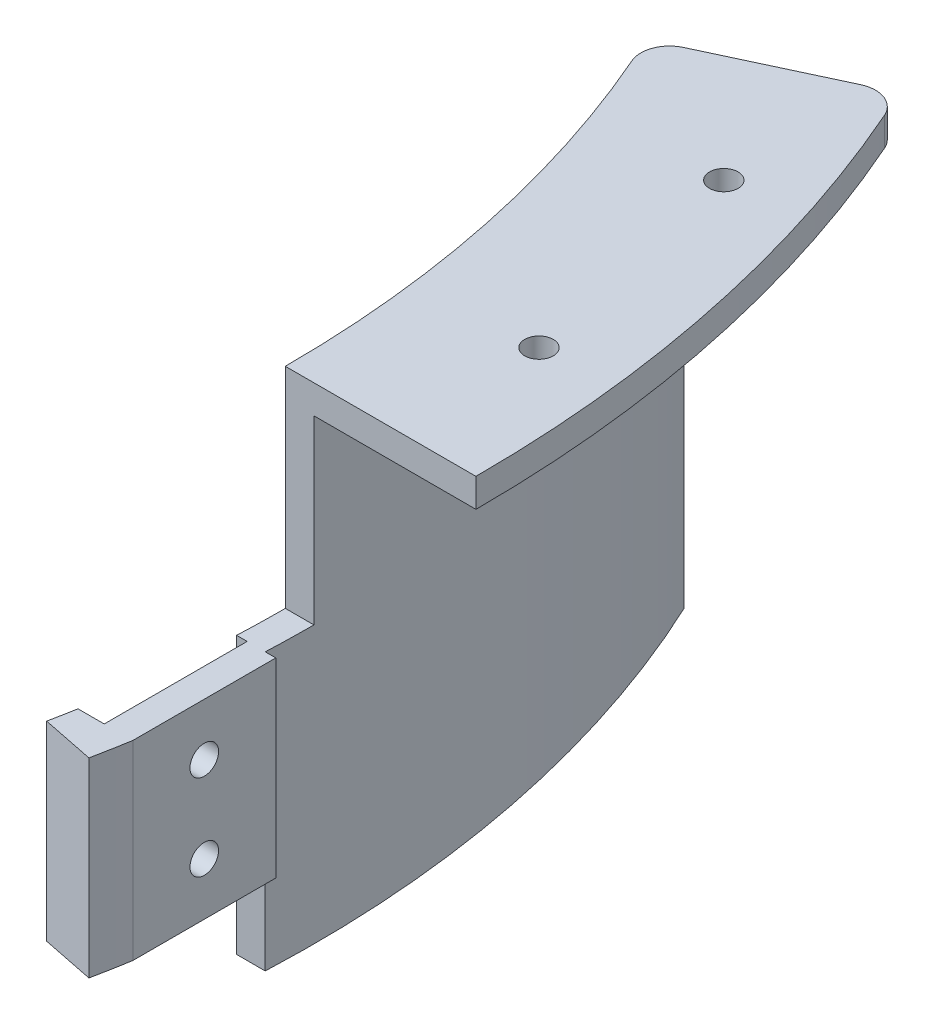
ISO-10303-21;
HEADER;
FILE_DESCRIPTION(('STEP AP214'),'2;1');
FILE_NAME('part.step','',(''),(''),'','','');
FILE_SCHEMA(('AUTOMOTIVE_DESIGN { 1 0 10303 214 1 1 1 1 }'));
ENDSEC;
DATA;
#1=APPLICATION_CONTEXT('core data for automotive mechanical design processes');
#2=APPLICATION_PROTOCOL_DEFINITION('international standard','automotive_design',2000,#1);
#3=PRODUCT_CONTEXT('',#1,'mechanical');
#4=PRODUCT('Part','Part','',(#3));
#5=PRODUCT_RELATED_PRODUCT_CATEGORY('part','',(#4));
#6=PRODUCT_DEFINITION_FORMATION('','',#4);
#7=PRODUCT_DEFINITION_CONTEXT('part definition',#1,'design');
#8=PRODUCT_DEFINITION('design','',#6,#7);
#9=PRODUCT_DEFINITION_SHAPE('','',#8);
#10=(LENGTH_UNIT() NAMED_UNIT(*) SI_UNIT(.MILLI.,.METRE.));
#11=(NAMED_UNIT(*) PLANE_ANGLE_UNIT() SI_UNIT($,.RADIAN.));
#12=(NAMED_UNIT(*) SI_UNIT($,.STERADIAN.) SOLID_ANGLE_UNIT());
#13=UNCERTAINTY_MEASURE_WITH_UNIT(LENGTH_MEASURE(1.E-05),#10,'distance_accuracy_value','');
#14=(GEOMETRIC_REPRESENTATION_CONTEXT(3) GLOBAL_UNCERTAINTY_ASSIGNED_CONTEXT((#13)) GLOBAL_UNIT_ASSIGNED_CONTEXT((#10,
#11,#12)) REPRESENTATION_CONTEXT('',''));
#15=CARTESIAN_POINT('',(0.,0.,0.));
#16=DIRECTION('',(0.,0.,1.));
#17=DIRECTION('',(1.,0.,0.));
#18=AXIS2_PLACEMENT_3D('',#15,#16,#17);
#19=CARTESIAN_POINT('',(0.,-64.,0.));
#20=DIRECTION('',(0.,1.,0.));
#21=DIRECTION('',(0.,0.,1.));
#22=AXIS2_PLACEMENT_3D('',#19,#20,#21);
#23=CYLINDRICAL_SURFACE('',#22,115.);
#24=CARTESIAN_POINT('',(0.,0.,0.));
#25=DIRECTION('',(0.,1.,0.));
#26=DIRECTION('',(0.,0.,1.));
#27=AXIS2_PLACEMENT_3D('',#24,#25,#26);
#28=CIRCLE('',#27,115.);
#29=CARTESIAN_POINT('',(115.,0.,0.));
#30=VERTEX_POINT('',#29);
#31=CARTESIAN_POINT('',(105.427327378107,0.,-45.9355923213096));
#32=VERTEX_POINT('',#31);
#33=EDGE_CURVE('E244',#30,#32,#28,.T.);
#34=ORIENTED_EDGE('',*,*,#33,.T.);
#35=DIRECTION('',(0.,1.,0.));
#36=VECTOR('',#35,1.);
#37=CARTESIAN_POINT('',(105.427327378106,-64.,-45.9355923213096));
#38=LINE('',#37,#36);
#39=CARTESIAN_POINT('',(105.427327378106,-51.,-45.9355923213096));
#40=VERTEX_POINT('',#39);
#41=EDGE_CURVE('E42',#32,#40,#38,.F.);
#42=ORIENTED_EDGE('',*,*,#41,.T.);
#43=CARTESIAN_POINT('',(0.,-51.,0.));
#44=DIRECTION('',(0.,1.,0.));
#45=DIRECTION('',(0.,0.,-1.));
#46=AXIS2_PLACEMENT_3D('',#43,#44,#45);
#47=CIRCLE('',#46,115.);
#48=CARTESIAN_POINT('',(114.891252930761,-51.,4.99999999999999));
#49=VERTEX_POINT('',#48);
#50=EDGE_CURVE('E174',#49,#40,#47,.T.);
#51=ORIENTED_EDGE('',*,*,#50,.F.);
#52=DIRECTION('',(0.,1.,0.));
#53=VECTOR('',#52,1.);
#54=CARTESIAN_POINT('',(114.891252930761,-64.,5.));
#55=LINE('',#54,#53);
#56=CARTESIAN_POINT('',(114.891252930761,-22.,5.00000000000003));
#57=VERTEX_POINT('',#56);
#58=EDGE_CURVE('E173',#49,#57,#55,.T.);
#59=ORIENTED_EDGE('',*,*,#58,.T.);
#60=CARTESIAN_POINT('',(0.,-22.,0.));
#61=DIRECTION('',(0.,1.,0.));
#62=DIRECTION('',(0.,0.,1.));
#63=AXIS2_PLACEMENT_3D('',#60,#61,#62);
#64=CIRCLE('',#63,115.);
#65=CARTESIAN_POINT('',(115.,-22.,0.));
#66=VERTEX_POINT('',#65);
#67=EDGE_CURVE('E193',#66,#57,#64,.F.);
#68=ORIENTED_EDGE('',*,*,#67,.F.);
#69=DIRECTION('',(0.,1.,0.));
#70=VECTOR('',#69,1.);
#71=CARTESIAN_POINT('',(115.,-22.,0.));
#72=LINE('',#71,#70);
#73=EDGE_CURVE('E208',#66,#30,#72,.T.);
#74=ORIENTED_EDGE('',*,*,#73,.T.);
#75=EDGE_LOOP('',(#34,#42,#51,#59,#68,#74));
#76=FACE_BOUND('',#75,.T.);
#77=ADVANCED_FACE('F34',(#76),#23,.F.);
#78=CARTESIAN_POINT('',(113.,-84.,5.));
#79=DIRECTION('',(0.,0.,-1.));
#80=DIRECTION('',(-1.,0.,0.));
#81=AXIS2_PLACEMENT_3D('',#78,#79,#80);
#82=PLANE('',#81);
#83=DIRECTION('',(-1.,0.,0.));
#84=VECTOR('',#83,1.);
#85=CARTESIAN_POINT('',(117.894020204589,-51.,5.));
#86=LINE('',#85,#84);
#87=CARTESIAN_POINT('',(117.894020204589,-51.,5.));
#88=VERTEX_POINT('',#87);
#89=EDGE_CURVE('E158',#88,#49,#86,.T.);
#90=ORIENTED_EDGE('',*,*,#89,.F.);
#91=DIRECTION('',(0.,-1.,0.));
#92=VECTOR('',#91,1.);
#93=CARTESIAN_POINT('',(117.894020204589,-3.,5.));
#94=LINE('',#93,#92);
#95=CARTESIAN_POINT('',(117.894020204589,-42.,5.));
#96=VERTEX_POINT('',#95);
#97=EDGE_CURVE('E170',#96,#88,#94,.T.);
#98=ORIENTED_EDGE('',*,*,#97,.F.);
#99=DIRECTION('',(1.,0.,0.));
#100=VECTOR('',#99,1.);
#101=CARTESIAN_POINT('',(116.,-42.,5.));
#102=LINE('',#101,#100);
#103=CARTESIAN_POINT('',(116.,-42.,5.));
#104=VERTEX_POINT('',#103);
#105=EDGE_CURVE('E316',#104,#96,#102,.T.);
#106=ORIENTED_EDGE('',*,*,#105,.F.);
#107=DIRECTION('',(0.,1.,0.));
#108=VECTOR('',#107,1.);
#109=CARTESIAN_POINT('',(116.,-84.,5.));
#110=LINE('',#109,#108);
#111=CARTESIAN_POINT('',(116.,-22.,5.));
#112=VERTEX_POINT('',#111);
#113=EDGE_CURVE('E242',#104,#112,#110,.T.);
#114=ORIENTED_EDGE('',*,*,#113,.T.);
#115=DIRECTION('',(1.,0.,0.));
#116=VECTOR('',#115,1.);
#117=CARTESIAN_POINT('',(0.,-22.,5.00000000000003));
#118=LINE('',#117,#116);
#119=EDGE_CURVE('E196',#57,#112,#118,.T.);
#120=ORIENTED_EDGE('',*,*,#119,.F.);
#121=ORIENTED_EDGE('',*,*,#58,.F.);
#122=EDGE_LOOP('',(#90,#98,#106,#114,#120,#121));
#123=FACE_BOUND('',#122,.T.);
#124=ADVANCED_FACE('F169',(#123),#82,.F.);
#125=CARTESIAN_POINT('',(0.,-3.,0.));
#126=DIRECTION('',(0.,-1.,0.));
#127=DIRECTION('',(0.,0.,-1.));
#128=AXIS2_PLACEMENT_3D('',#125,#126,#127);
#129=CYLINDRICAL_SURFACE('',#128,118.);
#130=CARTESIAN_POINT('',(0.,-51.,0.));
#131=DIRECTION('',(0.,-1.,0.));
#132=DIRECTION('',(0.,0.,-1.));
#133=AXIS2_PLACEMENT_3D('',#130,#131,#132);
#134=CIRCLE('',#133,118.);
#135=CARTESIAN_POINT('',(106.944318870325,-51.,-49.8689548854027));
#136=VERTEX_POINT('',#135);
#137=EDGE_CURVE('E155',#136,#88,#134,.T.);
#138=ORIENTED_EDGE('',*,*,#137,.F.);
#139=DIRECTION('',(0.,-1.,0.));
#140=VECTOR('',#139,1.);
#141=CARTESIAN_POINT('',(106.944318870325,-3.,-49.8689548854027));
#142=LINE('',#141,#140);
#143=CARTESIAN_POINT('',(106.944318870325,-3.,-49.8689548854027));
#144=VERTEX_POINT('',#143);
#145=EDGE_CURVE('E229',#144,#136,#142,.T.);
#146=ORIENTED_EDGE('',*,*,#145,.F.);
#147=CARTESIAN_POINT('',(0.,-3.,0.));
#148=DIRECTION('',(0.,1.,0.));
#149=DIRECTION('',(0.,0.,-1.));
#150=AXIS2_PLACEMENT_3D('',#147,#148,#149);
#151=CIRCLE('',#150,118.);
#152=CARTESIAN_POINT('',(118.,-3.,0.));
#153=VERTEX_POINT('',#152);
#154=EDGE_CURVE('E222',#153,#144,#151,.T.);
#155=ORIENTED_EDGE('',*,*,#154,.F.);
#156=DIRECTION('',(0.,-1.,0.));
#157=VECTOR('',#156,1.);
#158=CARTESIAN_POINT('',(118.,-3.,0.));
#159=LINE('',#158,#157);
#160=CARTESIAN_POINT('',(118.,-22.,0.));
#161=VERTEX_POINT('',#160);
#162=EDGE_CURVE('E212',#161,#153,#159,.F.);
#163=ORIENTED_EDGE('',*,*,#162,.F.);
#164=CARTESIAN_POINT('',(0.,-22.,0.));
#165=DIRECTION('',(0.,1.,0.));
#166=DIRECTION('',(0.,0.,1.));
#167=AXIS2_PLACEMENT_3D('',#164,#165,#166);
#168=CIRCLE('',#167,118.);
#169=CARTESIAN_POINT('',(117.894020204589,-22.,5.));
#170=VERTEX_POINT('',#169);
#171=EDGE_CURVE('E220',#170,#161,#168,.T.);
#172=ORIENTED_EDGE('',*,*,#171,.F.);
#173=DIRECTION('',(0.,-1.,0.));
#174=VECTOR('',#173,1.);
#175=CARTESIAN_POINT('',(117.894020204589,-3.,5.));
#176=LINE('',#175,#174);
#177=EDGE_CURVE('E180',#170,#96,#176,.T.);
#178=ORIENTED_EDGE('',*,*,#177,.T.);
#179=ORIENTED_EDGE('',*,*,#97,.T.);
#180=EDGE_LOOP('',(#138,#146,#155,#163,#172,#178,#179));
#181=FACE_BOUND('',#180,.T.);
#182=ADVANCED_FACE('F177',(#181),#129,.T.);
#183=CARTESIAN_POINT('',(0.,-64.,0.));
#184=DIRECTION('',(-0.422618261740701,0.,-0.906307787036649));
#185=DIRECTION('',(-0.906307787036649,0.,0.422618261740701));
#186=AXIS2_PLACEMENT_3D('',#183,#184,#185);
#187=PLANE('',#186);
#188=DIRECTION('',(0.906307787036652,0.,-0.422618261740695));
#189=VECTOR('',#188,1.);
#190=CARTESIAN_POINT('',(106.944318870325,-51.,-49.8689548854027));
#191=LINE('',#190,#189);
#192=CARTESIAN_POINT('',(106.9097506984,-51.,-49.8528354821059));
#193=VERTEX_POINT('',#192);
#194=EDGE_CURVE('E160',#193,#136,#191,.T.);
#195=ORIENTED_EDGE('',*,*,#194,.F.);
#196=DIRECTION('',(0.,-1.,0.));
#197=VECTOR('',#196,1.);
#198=CARTESIAN_POINT('',(106.9097506984,0.,-49.8528354821059));
#199=LINE('',#198,#197);
#200=CARTESIAN_POINT('',(106.9097506984,0.,-49.8528354821059));
#201=VERTEX_POINT('',#200);
#202=EDGE_CURVE('E272',#193,#201,#199,.F.);
#203=ORIENTED_EDGE('',*,*,#202,.T.);
#204=DIRECTION('',(-0.906307787036649,0.,0.422618261740701));
#205=VECTOR('',#204,1.);
#206=CARTESIAN_POINT('',(0.,0.,0.));
#207=LINE('',#206,#205);
#208=CARTESIAN_POINT('',(119.601727041651,0.,-55.7712012480857));
#209=VERTEX_POINT('',#208);
#210=EDGE_CURVE('E252',#209,#201,#207,.T.);
#211=ORIENTED_EDGE('',*,*,#210,.F.);
#212=DIRECTION('',(0.,1.,0.));
#213=VECTOR('',#212,1.);
#214=CARTESIAN_POINT('',(119.601727041651,-64.,-55.7712012480857));
#215=LINE('',#214,#213);
#216=CARTESIAN_POINT('',(119.601727041651,-3.,-55.7712012480857));
#217=VERTEX_POINT('',#216);
#218=EDGE_CURVE('E268',#209,#217,#215,.F.);
#219=ORIENTED_EDGE('',*,*,#218,.T.);
#220=DIRECTION('',(0.906307787036649,0.,-0.422618261740701));
#221=VECTOR('',#220,1.);
#222=CARTESIAN_POINT('',(106.944318870325,-3.,-49.8689548854027));
#223=LINE('',#222,#221);
#224=EDGE_CURVE('E224',#144,#217,#223,.T.);
#225=ORIENTED_EDGE('',*,*,#224,.F.);
#226=ORIENTED_EDGE('',*,*,#145,.T.);
#227=EDGE_LOOP('',(#195,#203,#211,#219,#225,#226));
#228=FACE_BOUND('',#227,.T.);
#229=ADVANCED_FACE('F284',(#228),#187,.T.);
#230=CARTESIAN_POINT('',(132.328890592719,-64.,26.7219893439865));
#231=DIRECTION('',(-0.197940661807307,0.,0.980214004390513));
#232=DIRECTION('',(0.980214004390513,0.,0.197940661807307));
#233=AXIS2_PLACEMENT_3D('',#230,#231,#232);
#234=PLANE('',#233);
#235=DIRECTION('',(0.,1.,0.));
#236=VECTOR('',#235,1.);
#237=CARTESIAN_POINT('',(112.724610504909,-64.,22.7631761078404));
#238=LINE('',#237,#236);
#239=CARTESIAN_POINT('',(112.724610504909,-42.,22.7631761078404));
#240=VERTEX_POINT('',#239);
#241=CARTESIAN_POINT('',(112.724610504909,-22.,22.7631761078403));
#242=VERTEX_POINT('',#241);
#243=EDGE_CURVE('E247',#240,#242,#238,.T.);
#244=ORIENTED_EDGE('',*,*,#243,.F.);
#245=DIRECTION('',(-0.980214004390514,0.,-0.197940661807305));
#246=VECTOR('',#245,1.);
#247=CARTESIAN_POINT('',(118.281412986176,-42.,23.8852955182423));
#248=LINE('',#247,#246);
#249=CARTESIAN_POINT('',(118.281412986176,-42.,23.8852955182423));
#250=VERTEX_POINT('',#249);
#251=EDGE_CURVE('E328',#250,#240,#248,.T.);
#252=ORIENTED_EDGE('',*,*,#251,.F.);
#253=DIRECTION('',(0.,-1.,0.));
#254=VECTOR('',#253,1.);
#255=CARTESIAN_POINT('',(118.281412986176,-3.,23.8852955182423));
#256=LINE('',#255,#254);
#257=CARTESIAN_POINT('',(118.281412986176,-22.,23.8852955182423));
#258=VERTEX_POINT('',#257);
#259=EDGE_CURVE('E238',#258,#250,#256,.T.);
#260=ORIENTED_EDGE('',*,*,#259,.F.);
#261=DIRECTION('',(0.980214004390513,0.,0.197940661807307));
#262=VECTOR('',#261,1.);
#263=CARTESIAN_POINT('',(0.,-22.,0.));
#264=LINE('',#263,#262);
#265=EDGE_CURVE('E207',#242,#258,#264,.T.);
#266=ORIENTED_EDGE('',*,*,#265,.F.);
#267=EDGE_LOOP('',(#244,#252,#260,#266));
#268=FACE_BOUND('',#267,.T.);
#269=ADVANCED_FACE('F348',(#268),#234,.T.);
#270=CARTESIAN_POINT('',(0.,-42.,0.));
#271=DIRECTION('',(0.,1.,0.));
#272=DIRECTION('',(0.,0.,-1.));
#273=AXIS2_PLACEMENT_3D('',#270,#271,#272);
#274=CIRCLE('',#273,115.);
#275=CARTESIAN_POINT('',(113.247516529061,-42.,20.));
#276=VERTEX_POINT('',#275);
#277=EDGE_CURVE('E187',#240,#276,#274,.T.);
#278=ORIENTED_EDGE('',*,*,#277,.F.);
#279=ORIENTED_EDGE('',*,*,#243,.T.);
#280=CARTESIAN_POINT('',(0.,-22.,0.));
#281=DIRECTION('',(0.,1.,0.));
#282=DIRECTION('',(0.,0.,1.));
#283=AXIS2_PLACEMENT_3D('',#280,#281,#282);
#284=CIRCLE('',#283,115.);
#285=CARTESIAN_POINT('',(113.247516529061,-22.,20.));
#286=VERTEX_POINT('',#285);
#287=EDGE_CURVE('E204',#286,#242,#284,.F.);
#288=ORIENTED_EDGE('',*,*,#287,.F.);
#289=DIRECTION('',(0.,1.,0.));
#290=VECTOR('',#289,1.);
#291=CARTESIAN_POINT('',(113.247516529061,-64.,20.));
#292=LINE('',#291,#290);
#293=EDGE_CURVE('E254',#286,#276,#292,.F.);
#294=ORIENTED_EDGE('',*,*,#293,.T.);
#295=EDGE_LOOP('',(#278,#279,#288,#294));
#296=FACE_BOUND('',#295,.T.);
#297=ADVANCED_FACE('F342',(#296),#23,.F.);
#298=CARTESIAN_POINT('',(116.,-84.,5.));
#299=DIRECTION('',(1.,0.,0.));
#300=DIRECTION('',(0.,0.,-1.));
#301=AXIS2_PLACEMENT_3D('',#298,#299,#300);
#302=PLANE('',#301);
#303=CARTESIAN_POINT('',(116.,-27.5,12.5));
#304=DIRECTION('',(1.,0.,0.));
#305=DIRECTION('',(0.,0.,-1.));
#306=AXIS2_PLACEMENT_3D('',#303,#304,#305);
#307=CIRCLE('',#306,1.5);
#308=CARTESIAN_POINT('',(116.,-27.5,11.));
#309=VERTEX_POINT('',#308);
#310=EDGE_CURVE('E321',#309,#309,#307,.T.);
#311=ORIENTED_EDGE('',*,*,#310,.T.);
#312=EDGE_LOOP('',(#311));
#313=FACE_BOUND('',#312,.T.);
#314=CARTESIAN_POINT('',(116.,-36.5,12.5));
#315=DIRECTION('',(1.,0.,0.));
#316=DIRECTION('',(0.,0.,-1.));
#317=AXIS2_PLACEMENT_3D('',#314,#315,#316);
#318=CIRCLE('',#317,1.5);
#319=CARTESIAN_POINT('',(116.,-36.5,11.));
#320=VERTEX_POINT('',#319);
#321=EDGE_CURVE('E436',#320,#320,#318,.T.);
#322=ORIENTED_EDGE('',*,*,#321,.T.);
#323=EDGE_LOOP('',(#322));
#324=FACE_BOUND('',#323,.T.);
#325=DIRECTION('',(0.,0.,-1.));
#326=VECTOR('',#325,1.);
#327=CARTESIAN_POINT('',(116.,-42.,20.));
#328=LINE('',#327,#326);
#329=CARTESIAN_POINT('',(116.,-42.,20.));
#330=VERTEX_POINT('',#329);
#331=EDGE_CURVE('E317',#330,#104,#328,.T.);
#332=ORIENTED_EDGE('',*,*,#331,.F.);
#333=DIRECTION('',(0.,1.,0.));
#334=VECTOR('',#333,1.);
#335=CARTESIAN_POINT('',(116.,-84.,20.));
#336=LINE('',#335,#334);
#337=CARTESIAN_POINT('',(116.,-22.,20.));
#338=VERTEX_POINT('',#337);
#339=EDGE_CURVE('E231',#330,#338,#336,.T.);
#340=ORIENTED_EDGE('',*,*,#339,.T.);
#341=DIRECTION('',(0.,0.,1.));
#342=VECTOR('',#341,1.);
#343=CARTESIAN_POINT('',(116.,-22.,-1.07321559047098E-13));
#344=LINE('',#343,#342);
#345=EDGE_CURVE('E199',#112,#338,#344,.T.);
#346=ORIENTED_EDGE('',*,*,#345,.F.);
#347=ORIENTED_EDGE('',*,*,#113,.F.);
#348=EDGE_LOOP('',(#332,#340,#346,#347));
#349=FACE_BOUND('',#348,.T.);
#350=ADVANCED_FACE('F376',(#313,#324,#349),#302,.F.);
#351=CARTESIAN_POINT('',(113.,-84.,20.));
#352=DIRECTION('',(0.,0.,1.));
#353=DIRECTION('',(1.,0.,0.));
#354=AXIS2_PLACEMENT_3D('',#351,#352,#353);
#355=PLANE('',#354);
#356=DIRECTION('',(1.,0.,0.));
#357=VECTOR('',#356,1.);
#358=CARTESIAN_POINT('',(113.247516529061,-42.,20.));
#359=LINE('',#358,#357);
#360=EDGE_CURVE('E182',#276,#330,#359,.T.);
#361=ORIENTED_EDGE('',*,*,#360,.F.);
#362=ORIENTED_EDGE('',*,*,#293,.F.);
#363=DIRECTION('',(-1.,0.,0.));
#364=VECTOR('',#363,1.);
#365=CARTESIAN_POINT('',(0.,-22.,20.));
#366=LINE('',#365,#364);
#367=EDGE_CURVE('E202',#338,#286,#366,.T.);
#368=ORIENTED_EDGE('',*,*,#367,.F.);
#369=ORIENTED_EDGE('',*,*,#339,.F.);
#370=EDGE_LOOP('',(#361,#362,#368,#369));
#371=FACE_BOUND('',#370,.T.);
#372=ADVANCED_FACE('F339',(#371),#355,.F.);
#373=CARTESIAN_POINT('',(119.,-3.,5.));
#374=DIRECTION('',(0.,0.,1.));
#375=DIRECTION('',(1.,0.,0.));
#376=AXIS2_PLACEMENT_3D('',#373,#374,#375);
#377=PLANE('',#376);
#378=CARTESIAN_POINT('',(119.,-42.,5.));
#379=VERTEX_POINT('',#378);
#380=EDGE_CURVE('E313',#96,#379,#102,.T.);
#381=ORIENTED_EDGE('',*,*,#380,.F.);
#382=ORIENTED_EDGE('',*,*,#177,.F.);
#383=DIRECTION('',(-1.,0.,0.));
#384=VECTOR('',#383,1.);
#385=CARTESIAN_POINT('',(119.,-22.,5.));
#386=LINE('',#385,#384);
#387=CARTESIAN_POINT('',(119.,-22.,5.));
#388=VERTEX_POINT('',#387);
#389=EDGE_CURVE('E218',#388,#170,#386,.T.);
#390=ORIENTED_EDGE('',*,*,#389,.F.);
#391=DIRECTION('',(0.,-1.,0.));
#392=VECTOR('',#391,1.);
#393=CARTESIAN_POINT('',(119.,-3.,5.));
#394=LINE('',#393,#392);
#395=EDGE_CURVE('E232',#388,#379,#394,.T.);
#396=ORIENTED_EDGE('',*,*,#395,.T.);
#397=EDGE_LOOP('',(#381,#382,#390,#396));
#398=FACE_BOUND('',#397,.T.);
#399=ADVANCED_FACE('F311',(#398),#377,.F.);
#400=CARTESIAN_POINT('',(119.,-3.,20.));
#401=DIRECTION('',(-1.,0.,0.));
#402=DIRECTION('',(0.,0.,1.));
#403=AXIS2_PLACEMENT_3D('',#400,#401,#402);
#404=PLANE('',#403);
#405=CARTESIAN_POINT('',(119.,-27.5,12.5));
#406=DIRECTION('',(1.,0.,0.));
#407=DIRECTION('',(0.,0.,-1.));
#408=AXIS2_PLACEMENT_3D('',#405,#406,#407);
#409=CIRCLE('',#408,1.5);
#410=CARTESIAN_POINT('',(119.,-27.5,11.));
#411=VERTEX_POINT('',#410);
#412=EDGE_CURVE('E433',#411,#411,#409,.T.);
#413=ORIENTED_EDGE('',*,*,#412,.F.);
#414=EDGE_LOOP('',(#413));
#415=FACE_BOUND('',#414,.T.);
#416=CARTESIAN_POINT('',(119.,-36.5,12.5));
#417=DIRECTION('',(1.,0.,0.));
#418=DIRECTION('',(0.,0.,-1.));
#419=AXIS2_PLACEMENT_3D('',#416,#417,#418);
#420=CIRCLE('',#419,1.5);
#421=CARTESIAN_POINT('',(119.,-36.5,11.));
#422=VERTEX_POINT('',#421);
#423=EDGE_CURVE('E432',#422,#422,#420,.T.);
#424=ORIENTED_EDGE('',*,*,#423,.F.);
#425=EDGE_LOOP('',(#424));
#426=FACE_BOUND('',#425,.T.);
#427=DIRECTION('',(0.,0.,1.));
#428=VECTOR('',#427,1.);
#429=CARTESIAN_POINT('',(119.,-42.,5.));
#430=LINE('',#429,#428);
#431=CARTESIAN_POINT('',(119.,-42.,20.));
#432=VERTEX_POINT('',#431);
#433=EDGE_CURVE('E319',#379,#432,#430,.T.);
#434=ORIENTED_EDGE('',*,*,#433,.F.);
#435=ORIENTED_EDGE('',*,*,#395,.F.);
#436=DIRECTION('',(0.,0.,-1.));
#437=VECTOR('',#436,1.);
#438=CARTESIAN_POINT('',(119.,-22.,20.));
#439=LINE('',#438,#437);
#440=CARTESIAN_POINT('',(119.,-22.,20.));
#441=VERTEX_POINT('',#440);
#442=EDGE_CURVE('E216',#441,#388,#439,.T.);
#443=ORIENTED_EDGE('',*,*,#442,.F.);
#444=DIRECTION('',(0.,-1.,0.));
#445=VECTOR('',#444,1.);
#446=CARTESIAN_POINT('',(119.,-3.,20.));
#447=LINE('',#446,#445);
#448=EDGE_CURVE('E235',#441,#432,#447,.T.);
#449=ORIENTED_EDGE('',*,*,#448,.T.);
#450=EDGE_LOOP('',(#434,#435,#443,#449));
#451=FACE_BOUND('',#450,.T.);
#452=ADVANCED_FACE('F355',(#415,#426,#451),#404,.F.);
#453=CARTESIAN_POINT('',(0.,-3.,0.));
#454=DIRECTION('',(0.,-1.,0.));
#455=DIRECTION('',(0.,0.,-1.));
#456=AXIS2_PLACEMENT_3D('',#453,#454,#455);
#457=CYLINDRICAL_SURFACE('',#456,120.668968670491);
#458=CARTESIAN_POINT('',(0.,-42.,0.));
#459=DIRECTION('',(0.,-1.,0.));
#460=DIRECTION('',(0.,0.,-1.));
#461=AXIS2_PLACEMENT_3D('',#458,#459,#460);
#462=CIRCLE('',#461,120.668968670491);
#463=EDGE_CURVE('E326',#432,#250,#462,.T.);
#464=ORIENTED_EDGE('',*,*,#463,.F.);
#465=ORIENTED_EDGE('',*,*,#448,.F.);
#466=CARTESIAN_POINT('',(0.,-22.,0.));
#467=DIRECTION('',(0.,1.,0.));
#468=DIRECTION('',(0.,0.,1.));
#469=AXIS2_PLACEMENT_3D('',#466,#467,#468);
#470=CIRCLE('',#469,120.668968670491);
#471=EDGE_CURVE('E261',#258,#441,#470,.T.);
#472=ORIENTED_EDGE('',*,*,#471,.F.);
#473=ORIENTED_EDGE('',*,*,#259,.T.);
#474=EDGE_LOOP('',(#464,#465,#472,#473));
#475=FACE_BOUND('',#474,.T.);
#476=ADVANCED_FACE('F351',(#475),#457,.T.);
#477=CARTESIAN_POINT('',(0.,-64.,0.));
#478=DIRECTION('',(0.,1.,0.));
#479=DIRECTION('',(0.,0.,1.));
#480=AXIS2_PLACEMENT_3D('',#477,#478,#479);
#481=CYLINDRICAL_SURFACE('',#480,135.);
#482=CARTESIAN_POINT('',(0.,-3.,0.));
#483=DIRECTION('',(0.,-1.,0.));
#484=DIRECTION('',(0.,0.,-1.));
#485=AXIS2_PLACEMENT_3D('',#482,#483,#484);
#486=CIRCLE('',#485,135.);
#487=CARTESIAN_POINT('',(123.616617777484,-3.,-54.2580114753161));
#488=VERTEX_POINT('',#487);
#489=CARTESIAN_POINT('',(135.,-3.,0.));
#490=VERTEX_POINT('',#489);
#491=EDGE_CURVE('E227',#488,#490,#486,.T.);
#492=ORIENTED_EDGE('',*,*,#491,.F.);
#493=DIRECTION('',(0.,1.,0.));
#494=VECTOR('',#493,1.);
#495=CARTESIAN_POINT('',(123.616617777484,-64.,-54.2580114753161));
#496=LINE('',#495,#494);
#497=CARTESIAN_POINT('',(123.616617777484,0.,-54.2580114753161));
#498=VERTEX_POINT('',#497);
#499=EDGE_CURVE('E263',#488,#498,#496,.T.);
#500=ORIENTED_EDGE('',*,*,#499,.T.);
#501=CARTESIAN_POINT('',(0.,0.,0.));
#502=DIRECTION('',(0.,1.,0.));
#503=DIRECTION('',(0.,0.,1.));
#504=AXIS2_PLACEMENT_3D('',#501,#502,#503);
#505=CIRCLE('',#504,135.);
#506=CARTESIAN_POINT('',(135.,0.,0.));
#507=VERTEX_POINT('',#506);
#508=EDGE_CURVE('E249',#507,#498,#505,.T.);
#509=ORIENTED_EDGE('',*,*,#508,.F.);
#510=DIRECTION('',(0.,1.,0.));
#511=VECTOR('',#510,1.);
#512=CARTESIAN_POINT('',(135.,-22.,0.));
#513=LINE('',#512,#511);
#514=EDGE_CURVE('E210',#490,#507,#513,.T.);
#515=ORIENTED_EDGE('',*,*,#514,.F.);
#516=EDGE_LOOP('',(#492,#500,#509,#515));
#517=FACE_BOUND('',#516,.T.);
#518=ADVANCED_FACE('F296',(#517),#481,.T.);
#519=CARTESIAN_POINT('',(0.,0.,0.));
#520=DIRECTION('',(0.,1.,0.));
#521=DIRECTION('',(0.,0.,1.));
#522=AXIS2_PLACEMENT_3D('',#519,#520,#521);
#523=PLANE('',#522);
#524=CARTESIAN_POINT('',(121.091047044846,0.,-39.9150137865815));
#525=DIRECTION('',(0.,1.,0.));
#526=DIRECTION('',(0.,0.,1.));
#527=AXIS2_PLACEMENT_3D('',#524,#525,#526);
#528=CIRCLE('',#527,1.5);
#529=CARTESIAN_POINT('',(121.091047044846,0.,-38.4150137865816));
#530=VERTEX_POINT('',#529);
#531=EDGE_CURVE('E276',#530,#530,#528,.T.);
#532=ORIENTED_EDGE('',*,*,#531,.F.);
#533=EDGE_LOOP('',(#532));
#534=FACE_BOUND('',#533,.T.);
#535=CARTESIAN_POINT('',(126.614572621006,0.,-15.));
#536=DIRECTION('',(0.,1.,0.));
#537=DIRECTION('',(0.,0.,1.));
#538=AXIS2_PLACEMENT_3D('',#535,#536,#537);
#539=CIRCLE('',#538,1.49999999999997);
#540=CARTESIAN_POINT('',(126.614572621006,0.,-13.5));
#541=VERTEX_POINT('',#540);
#542=EDGE_CURVE('E424',#541,#541,#539,.T.);
#543=ORIENTED_EDGE('',*,*,#542,.F.);
#544=EDGE_LOOP('',(#543));
#545=FACE_BOUND('',#544,.T.);
#546=ORIENTED_EDGE('',*,*,#210,.T.);
#547=CARTESIAN_POINT('',(108.177605483622,0.,-47.133912120996));
#548=DIRECTION('',(0.,1.,0.));
#549=DIRECTION('',(0.,0.,1.));
#550=AXIS2_PLACEMENT_3D('',#547,#548,#549);
#551=CIRCLE('',#550,3.);
#552=EDGE_CURVE('E56',#201,#32,#551,.T.);
#553=ORIENTED_EDGE('',*,*,#552,.T.);
#554=ORIENTED_EDGE('',*,*,#33,.F.);
#555=DIRECTION('',(1.,0.,0.));
#556=VECTOR('',#555,1.);
#557=CARTESIAN_POINT('',(0.,0.,0.));
#558=LINE('',#557,#556);
#559=EDGE_CURVE('E181',#30,#507,#558,.T.);
#560=ORIENTED_EDGE('',*,*,#559,.T.);
#561=ORIENTED_EDGE('',*,*,#508,.T.);
#562=CARTESIAN_POINT('',(120.869581826873,0.,-53.0522778869758));
#563=DIRECTION('',(0.,1.,0.));
#564=DIRECTION('',(0.,0.,1.));
#565=AXIS2_PLACEMENT_3D('',#562,#563,#564);
#566=CIRCLE('',#565,3.);
#567=EDGE_CURVE('E266',#498,#209,#566,.T.);
#568=ORIENTED_EDGE('',*,*,#567,.T.);
#569=EDGE_LOOP('',(#546,#553,#554,#560,#561,#568));
#570=FACE_BOUND('',#569,.T.);
#571=ADVANCED_FACE('F288',(#534,#545,#570),#523,.T.);
#572=CARTESIAN_POINT('',(0.,-3.,0.));
#573=DIRECTION('',(0.,-1.,0.));
#574=DIRECTION('',(0.,0.,-1.));
#575=AXIS2_PLACEMENT_3D('',#572,#573,#574);
#576=PLANE('',#575);
#577=CARTESIAN_POINT('',(121.091047044846,-3.,-39.9150137865815));
#578=DIRECTION('',(0.,-1.,0.));
#579=DIRECTION('',(0.,0.,-1.));
#580=AXIS2_PLACEMENT_3D('',#577,#578,#579);
#581=CIRCLE('',#580,1.5);
#582=CARTESIAN_POINT('',(121.091047044846,-3.,-41.4150137865815));
#583=VERTEX_POINT('',#582);
#584=EDGE_CURVE('E165',#583,#583,#581,.T.);
#585=ORIENTED_EDGE('',*,*,#584,.F.);
#586=EDGE_LOOP('',(#585));
#587=FACE_BOUND('',#586,.T.);
#588=CARTESIAN_POINT('',(126.614572621006,-3.,-15.));
#589=DIRECTION('',(0.,-1.,0.));
#590=DIRECTION('',(0.,0.,-1.));
#591=AXIS2_PLACEMENT_3D('',#588,#589,#590);
#592=CIRCLE('',#591,1.49999999999997);
#593=CARTESIAN_POINT('',(126.614572621006,-3.,-16.5));
#594=VERTEX_POINT('',#593);
#595=EDGE_CURVE('E273',#594,#594,#592,.T.);
#596=ORIENTED_EDGE('',*,*,#595,.F.);
#597=EDGE_LOOP('',(#596));
#598=FACE_BOUND('',#597,.T.);
#599=ORIENTED_EDGE('',*,*,#224,.T.);
#600=CARTESIAN_POINT('',(120.869581826873,-3.,-53.0522778869758));
#601=DIRECTION('',(0.,-1.,0.));
#602=DIRECTION('',(0.,0.,-1.));
#603=AXIS2_PLACEMENT_3D('',#600,#601,#602);
#604=CIRCLE('',#603,3.);
#605=EDGE_CURVE('E270',#217,#488,#604,.T.);
#606=ORIENTED_EDGE('',*,*,#605,.T.);
#607=ORIENTED_EDGE('',*,*,#491,.T.);
#608=DIRECTION('',(-1.,0.,0.));
#609=VECTOR('',#608,1.);
#610=CARTESIAN_POINT('',(0.,-3.,0.));
#611=LINE('',#610,#609);
#612=EDGE_CURVE('E258',#490,#153,#611,.T.);
#613=ORIENTED_EDGE('',*,*,#612,.T.);
#614=ORIENTED_EDGE('',*,*,#154,.T.);
#615=EDGE_LOOP('',(#599,#606,#607,#613,#614));
#616=FACE_BOUND('',#615,.T.);
#617=ADVANCED_FACE('F300',(#587,#598,#616),#576,.T.);
#618=CARTESIAN_POINT('',(0.,-22.,0.));
#619=DIRECTION('',(0.,1.,0.));
#620=DIRECTION('',(0.,0.,1.));
#621=AXIS2_PLACEMENT_3D('',#618,#619,#620);
#622=PLANE('',#621);
#623=ORIENTED_EDGE('',*,*,#171,.T.);
#624=DIRECTION('',(1.,0.,0.));
#625=VECTOR('',#624,1.);
#626=CARTESIAN_POINT('',(0.,-22.,0.));
#627=LINE('',#626,#625);
#628=EDGE_CURVE('E185',#66,#161,#627,.T.);
#629=ORIENTED_EDGE('',*,*,#628,.F.);
#630=ORIENTED_EDGE('',*,*,#67,.T.);
#631=ORIENTED_EDGE('',*,*,#119,.T.);
#632=ORIENTED_EDGE('',*,*,#345,.T.);
#633=ORIENTED_EDGE('',*,*,#367,.T.);
#634=ORIENTED_EDGE('',*,*,#287,.T.);
#635=ORIENTED_EDGE('',*,*,#265,.T.);
#636=ORIENTED_EDGE('',*,*,#471,.T.);
#637=ORIENTED_EDGE('',*,*,#442,.T.);
#638=ORIENTED_EDGE('',*,*,#389,.T.);
#639=EDGE_LOOP('',(#623,#629,#630,#631,#632,#633,#634,#635,#636,#637,#638));
#640=FACE_BOUND('',#639,.T.);
#641=ADVANCED_FACE('F344',(#640),#622,.T.);
#642=CARTESIAN_POINT('',(0.,-22.,0.));
#643=DIRECTION('',(0.,0.,1.));
#644=DIRECTION('',(1.,0.,0.));
#645=AXIS2_PLACEMENT_3D('',#642,#643,#644);
#646=PLANE('',#645);
#647=ORIENTED_EDGE('',*,*,#162,.T.);
#648=ORIENTED_EDGE('',*,*,#612,.F.);
#649=ORIENTED_EDGE('',*,*,#514,.T.);
#650=ORIENTED_EDGE('',*,*,#559,.F.);
#651=ORIENTED_EDGE('',*,*,#73,.F.);
#652=ORIENTED_EDGE('',*,*,#628,.T.);
#653=EDGE_LOOP('',(#647,#648,#649,#650,#651,#652));
#654=FACE_BOUND('',#653,.T.);
#655=ADVANCED_FACE('F303',(#654),#646,.T.);
#656=CARTESIAN_POINT('',(0.,-42.,0.));
#657=DIRECTION('',(0.,-1.,0.));
#658=DIRECTION('',(0.,0.,-1.));
#659=AXIS2_PLACEMENT_3D('',#656,#657,#658);
#660=PLANE('',#659);
#661=ORIENTED_EDGE('',*,*,#331,.T.);
#662=ORIENTED_EDGE('',*,*,#105,.T.);
#663=ORIENTED_EDGE('',*,*,#380,.T.);
#664=ORIENTED_EDGE('',*,*,#433,.T.);
#665=ORIENTED_EDGE('',*,*,#463,.T.);
#666=ORIENTED_EDGE('',*,*,#251,.T.);
#667=ORIENTED_EDGE('',*,*,#277,.T.);
#668=ORIENTED_EDGE('',*,*,#360,.T.);
#669=EDGE_LOOP('',(#661,#662,#663,#664,#665,#666,#667,#668));
#670=FACE_BOUND('',#669,.T.);
#671=ADVANCED_FACE('F331',(#670),#660,.T.);
#672=CARTESIAN_POINT('',(120.869581826873,-64.,-53.0522778869758));
#673=DIRECTION('',(0.,1.,0.));
#674=DIRECTION('',(0.,0.,1.));
#675=AXIS2_PLACEMENT_3D('',#672,#673,#674);
#676=CYLINDRICAL_SURFACE('',#675,3.);
#677=ORIENTED_EDGE('',*,*,#605,.F.);
#678=ORIENTED_EDGE('',*,*,#218,.F.);
#679=ORIENTED_EDGE('',*,*,#567,.F.);
#680=ORIENTED_EDGE('',*,*,#499,.F.);
#681=EDGE_LOOP('',(#677,#678,#679,#680));
#682=FACE_BOUND('',#681,.T.);
#683=ADVANCED_FACE('F293',(#682),#676,.T.);
#684=CARTESIAN_POINT('',(109.,-36.5,12.5));
#685=DIRECTION('',(1.,0.,0.));
#686=DIRECTION('',(0.,0.,-1.));
#687=AXIS2_PLACEMENT_3D('',#684,#685,#686);
#688=CYLINDRICAL_SURFACE('',#687,1.5);
#689=ORIENTED_EDGE('',*,*,#423,.T.);
#690=EDGE_LOOP('',(#689));
#691=FACE_BOUND('',#690,.T.);
#692=ORIENTED_EDGE('',*,*,#321,.F.);
#693=EDGE_LOOP('',(#692));
#694=FACE_BOUND('',#693,.T.);
#695=ADVANCED_FACE('F390',(#691,#694),#688,.F.);
#696=CARTESIAN_POINT('',(109.,-27.5,12.5));
#697=DIRECTION('',(1.,0.,0.));
#698=DIRECTION('',(0.,0.,-1.));
#699=AXIS2_PLACEMENT_3D('',#696,#697,#698);
#700=CYLINDRICAL_SURFACE('',#699,1.5);
#701=ORIENTED_EDGE('',*,*,#412,.T.);
#702=EDGE_LOOP('',(#701));
#703=FACE_BOUND('',#702,.T.);
#704=ORIENTED_EDGE('',*,*,#310,.F.);
#705=EDGE_LOOP('',(#704));
#706=FACE_BOUND('',#705,.T.);
#707=ADVANCED_FACE('F395',(#703,#706),#700,.F.);
#708=CARTESIAN_POINT('',(0.,-51.,0.));
#709=DIRECTION('',(0.,-1.,0.));
#710=DIRECTION('',(0.,0.,-1.));
#711=AXIS2_PLACEMENT_3D('',#708,#709,#710);
#712=PLANE('',#711);
#713=ORIENTED_EDGE('',*,*,#50,.T.);
#714=CARTESIAN_POINT('',(108.177605483622,-51.,-47.133912120996));
#715=DIRECTION('',(0.,-1.,0.));
#716=DIRECTION('',(0.,0.,-1.));
#717=AXIS2_PLACEMENT_3D('',#714,#715,#716);
#718=CIRCLE('',#717,3.);
#719=EDGE_CURVE('E11',#40,#193,#718,.T.);
#720=ORIENTED_EDGE('',*,*,#719,.T.);
#721=ORIENTED_EDGE('',*,*,#194,.T.);
#722=ORIENTED_EDGE('',*,*,#137,.T.);
#723=ORIENTED_EDGE('',*,*,#89,.T.);
#724=EDGE_LOOP('',(#713,#720,#721,#722,#723));
#725=FACE_BOUND('',#724,.T.);
#726=ADVANCED_FACE('F157',(#725),#712,.T.);
#727=CARTESIAN_POINT('',(126.614572621006,-10.,-15.));
#728=DIRECTION('',(0.,1.,0.));
#729=DIRECTION('',(0.,0.,1.));
#730=AXIS2_PLACEMENT_3D('',#727,#728,#729);
#731=CYLINDRICAL_SURFACE('',#730,1.49999999999997);
#732=ORIENTED_EDGE('',*,*,#595,.T.);
#733=EDGE_LOOP('',(#732));
#734=FACE_BOUND('',#733,.T.);
#735=ORIENTED_EDGE('',*,*,#542,.T.);
#736=EDGE_LOOP('',(#735));
#737=FACE_BOUND('',#736,.T.);
#738=ADVANCED_FACE('F417',(#734,#737),#731,.F.);
#739=CARTESIAN_POINT('',(121.091047044846,-10.,-39.9150137865815));
#740=DIRECTION('',(0.,1.,0.));
#741=DIRECTION('',(0.,0.,1.));
#742=AXIS2_PLACEMENT_3D('',#739,#740,#741);
#743=CYLINDRICAL_SURFACE('',#742,1.5);
#744=ORIENTED_EDGE('',*,*,#584,.T.);
#745=EDGE_LOOP('',(#744));
#746=FACE_BOUND('',#745,.T.);
#747=ORIENTED_EDGE('',*,*,#531,.T.);
#748=EDGE_LOOP('',(#747));
#749=FACE_BOUND('',#748,.T.);
#750=ADVANCED_FACE('F420',(#746,#749),#743,.F.);
#751=CARTESIAN_POINT('',(108.177605483622,-64.,-47.133912120996));
#752=DIRECTION('',(0.,1.,0.));
#753=DIRECTION('',(0.,0.,1.));
#754=AXIS2_PLACEMENT_3D('',#751,#752,#753);
#755=CYLINDRICAL_SURFACE('',#754,3.);
#756=ORIENTED_EDGE('',*,*,#719,.F.);
#757=ORIENTED_EDGE('',*,*,#41,.F.);
#758=ORIENTED_EDGE('',*,*,#552,.F.);
#759=ORIENTED_EDGE('',*,*,#202,.F.);
#760=EDGE_LOOP('',(#756,#757,#758,#759));
#761=FACE_BOUND('',#760,.T.);
#762=ADVANCED_FACE('F36',(#761),#755,.T.);
#763=CLOSED_SHELL('',(#77,#124,#182,#229,#269,#297,#350,#372,#399,#452,#476,#518,#571,#617,#641,
#655,#671,#683,#695,#707,#726,#738,#750,#762));
#764=MANIFOLD_SOLID_BREP('B2',#763);
#765=ADVANCED_BREP_SHAPE_REPRESENTATION('',(#18,#764),#14);
#766=SHAPE_DEFINITION_REPRESENTATION(#9,#765);
ENDSEC;
END-ISO-10303-21;
